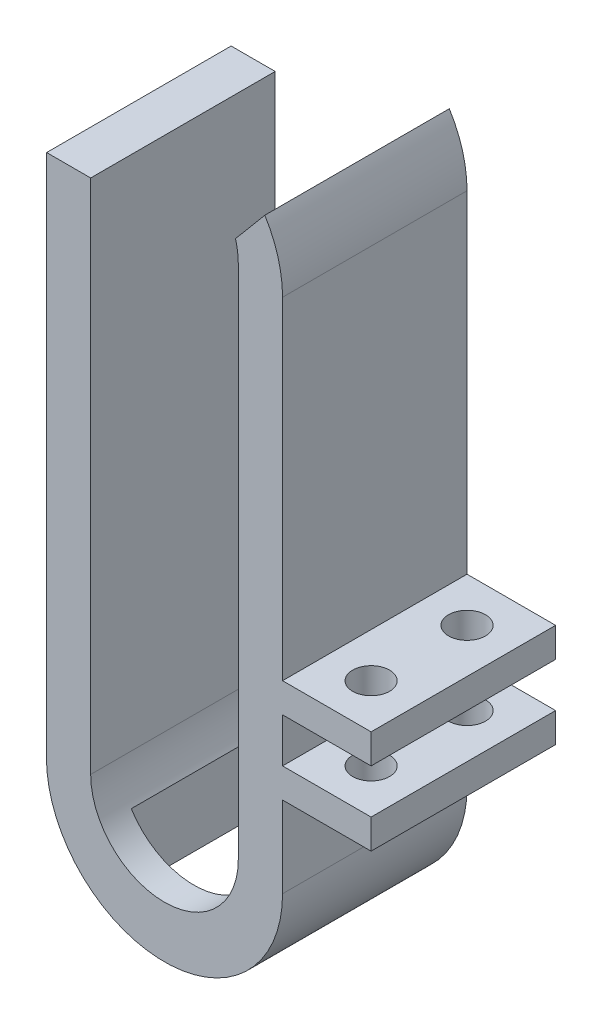
ISO-10303-21;
HEADER;
FILE_DESCRIPTION(('STEP AP214'),'2;1');
FILE_NAME('part.step','',(''),(''),'','','');
FILE_SCHEMA(('AUTOMOTIVE_DESIGN { 1 0 10303 214 1 1 1 1 }'));
ENDSEC;
DATA;
#1=APPLICATION_CONTEXT('core data for automotive mechanical design processes');
#2=APPLICATION_PROTOCOL_DEFINITION('international standard','automotive_design',2000,#1);
#3=PRODUCT_CONTEXT('',#1,'mechanical');
#4=PRODUCT('Part','Part','',(#3));
#5=PRODUCT_RELATED_PRODUCT_CATEGORY('part','',(#4));
#6=PRODUCT_DEFINITION_FORMATION('','',#4);
#7=PRODUCT_DEFINITION_CONTEXT('part definition',#1,'design');
#8=PRODUCT_DEFINITION('design','',#6,#7);
#9=PRODUCT_DEFINITION_SHAPE('','',#8);
#10=(LENGTH_UNIT() NAMED_UNIT(*) SI_UNIT(.MILLI.,.METRE.));
#11=(NAMED_UNIT(*) PLANE_ANGLE_UNIT() SI_UNIT($,.RADIAN.));
#12=(NAMED_UNIT(*) SI_UNIT($,.STERADIAN.) SOLID_ANGLE_UNIT());
#13=UNCERTAINTY_MEASURE_WITH_UNIT(LENGTH_MEASURE(1.E-05),#10,'distance_accuracy_value','');
#14=(GEOMETRIC_REPRESENTATION_CONTEXT(3) GLOBAL_UNCERTAINTY_ASSIGNED_CONTEXT((#13)) GLOBAL_UNIT_ASSIGNED_CONTEXT((#10,
#11,#12)) REPRESENTATION_CONTEXT('',''));
#15=CARTESIAN_POINT('',(0.,0.,0.));
#16=DIRECTION('',(0.,0.,1.));
#17=DIRECTION('',(1.,0.,0.));
#18=AXIS2_PLACEMENT_3D('',#15,#16,#17);
#19=CARTESIAN_POINT('',(7.99999999999995,0.,12.5));
#20=DIRECTION('',(1.,0.,0.));
#21=DIRECTION('',(0.,1.,0.));
#22=AXIS2_PLACEMENT_3D('',#19,#20,#21);
#23=PLANE('',#22);
#24=DIRECTION('',(0.,-1.,0.));
#25=VECTOR('',#24,1.);
#26=CARTESIAN_POINT('',(7.99999999999995,0.,0.));
#27=LINE('',#26,#25);
#28=CARTESIAN_POINT('',(7.99999999999994,-7.5,0.));
#29=VERTEX_POINT('',#28);
#30=CARTESIAN_POINT('',(7.99999999999995,-10.5,0.));
#31=VERTEX_POINT('',#30);
#32=EDGE_CURVE('E278',#29,#31,#27,.T.);
#33=ORIENTED_EDGE('',*,*,#32,.F.);
#34=DIRECTION('',(0.,0.,-1.));
#35=VECTOR('',#34,1.);
#36=CARTESIAN_POINT('',(7.99999999999995,-7.5,12.5));
#37=LINE('',#36,#35);
#38=CARTESIAN_POINT('',(7.99999999999995,-7.5,12.5));
#39=VERTEX_POINT('',#38);
#40=EDGE_CURVE('E347',#39,#29,#37,.T.);
#41=ORIENTED_EDGE('',*,*,#40,.F.);
#42=DIRECTION('',(0.,-1.,0.));
#43=VECTOR('',#42,1.);
#44=CARTESIAN_POINT('',(7.99999999999995,0.,12.5));
#45=LINE('',#44,#43);
#46=CARTESIAN_POINT('',(7.99999999999995,-10.5,12.5));
#47=VERTEX_POINT('',#46);
#48=EDGE_CURVE('E308',#39,#47,#45,.T.);
#49=ORIENTED_EDGE('',*,*,#48,.T.);
#50=DIRECTION('',(0.,0.,1.));
#51=VECTOR('',#50,1.);
#52=CARTESIAN_POINT('',(7.99999999999995,-10.5,12.5));
#53=LINE('',#52,#51);
#54=EDGE_CURVE('E320',#31,#47,#53,.T.);
#55=ORIENTED_EDGE('',*,*,#54,.F.);
#56=EDGE_LOOP('',(#33,#41,#49,#55));
#57=FACE_BOUND('',#56,.T.);
#58=ADVANCED_FACE('F37',(#57),#23,.T.);
#59=CARTESIAN_POINT('',(7.99999999999995,17.,12.5));
#60=VERTEX_POINT('',#59);
#61=CARTESIAN_POINT('',(7.99999999999995,-5.5,12.5));
#62=VERTEX_POINT('',#61);
#63=EDGE_CURVE('E305',#60,#62,#45,.T.);
#64=ORIENTED_EDGE('',*,*,#63,.T.);
#65=DIRECTION('',(0.,0.,1.));
#66=VECTOR('',#65,1.);
#67=CARTESIAN_POINT('',(7.99999999999995,-5.5,12.5));
#68=LINE('',#67,#66);
#69=CARTESIAN_POINT('',(7.99999999999995,-5.5,0.));
#70=VERTEX_POINT('',#69);
#71=EDGE_CURVE('E344',#70,#62,#68,.T.);
#72=ORIENTED_EDGE('',*,*,#71,.F.);
#73=CARTESIAN_POINT('',(7.99999999999995,17.,0.));
#74=VERTEX_POINT('',#73);
#75=EDGE_CURVE('E275',#74,#70,#27,.T.);
#76=ORIENTED_EDGE('',*,*,#75,.F.);
#77=DIRECTION('',(0.,0.,-1.));
#78=VECTOR('',#77,1.);
#79=CARTESIAN_POINT('',(7.99999999999995,17.,12.5));
#80=LINE('',#79,#78);
#81=EDGE_CURVE('E194',#60,#74,#80,.T.);
#82=ORIENTED_EDGE('',*,*,#81,.F.);
#83=EDGE_LOOP('',(#64,#72,#76,#82));
#84=FACE_BOUND('',#83,.T.);
#85=ADVANCED_FACE('F401',(#84),#23,.T.);
#86=CARTESIAN_POINT('',(7.99999999999994,-12.5,0.));
#87=VERTEX_POINT('',#86);
#88=CARTESIAN_POINT('',(7.99999999999994,-18.,0.));
#89=VERTEX_POINT('',#88);
#90=EDGE_CURVE('E279',#87,#89,#27,.T.);
#91=ORIENTED_EDGE('',*,*,#90,.F.);
#92=DIRECTION('',(0.,0.,-1.));
#93=VECTOR('',#92,1.);
#94=CARTESIAN_POINT('',(7.99999999999995,-12.5,12.5));
#95=LINE('',#94,#93);
#96=CARTESIAN_POINT('',(7.99999999999995,-12.5,12.5));
#97=VERTEX_POINT('',#96);
#98=EDGE_CURVE('E324',#97,#87,#95,.T.);
#99=ORIENTED_EDGE('',*,*,#98,.F.);
#100=CARTESIAN_POINT('',(7.99999999999994,-18.,12.5));
#101=VERTEX_POINT('',#100);
#102=EDGE_CURVE('E249',#97,#101,#45,.T.);
#103=ORIENTED_EDGE('',*,*,#102,.T.);
#104=DIRECTION('',(0.,0.,-1.));
#105=VECTOR('',#104,1.);
#106=CARTESIAN_POINT('',(7.99999999999994,-18.,12.5));
#107=LINE('',#106,#105);
#108=EDGE_CURVE('E242',#101,#89,#107,.T.);
#109=ORIENTED_EDGE('',*,*,#108,.T.);
#110=EDGE_LOOP('',(#91,#99,#103,#109));
#111=FACE_BOUND('',#110,.T.);
#112=ADVANCED_FACE('F39',(#111),#23,.T.);
#113=CARTESIAN_POINT('',(0.,17.,12.5));
#114=DIRECTION('',(0.,0.,-1.));
#115=DIRECTION('',(-1.,0.,0.));
#116=AXIS2_PLACEMENT_3D('',#113,#114,#115);
#117=CYLINDRICAL_SURFACE('',#116,7.99999999999998);
#118=CARTESIAN_POINT('',(0.,17.,0.));
#119=DIRECTION('',(0.,0.,1.));
#120=DIRECTION('',(1.,0.,0.));
#121=AXIS2_PLACEMENT_3D('',#118,#119,#120);
#122=CIRCLE('',#121,7.99999999999998);
#123=CARTESIAN_POINT('',(6.80020674968517,21.2139278780653,0.));
#124=VERTEX_POINT('',#123);
#125=EDGE_CURVE('E272',#74,#124,#122,.T.);
#126=ORIENTED_EDGE('',*,*,#125,.T.);
#127=DIRECTION('',(0.,0.,-1.));
#128=VECTOR('',#127,1.);
#129=CARTESIAN_POINT('',(6.80020674968517,21.2139278780653,12.5));
#130=LINE('',#129,#128);
#131=CARTESIAN_POINT('',(6.80020674968517,21.2139278780653,12.5));
#132=VERTEX_POINT('',#131);
#133=EDGE_CURVE('E222',#132,#124,#130,.T.);
#134=ORIENTED_EDGE('',*,*,#133,.F.);
#135=CARTESIAN_POINT('',(0.,17.,12.5));
#136=DIRECTION('',(0.,0.,1.));
#137=DIRECTION('',(1.,0.,0.));
#138=AXIS2_PLACEMENT_3D('',#135,#136,#137);
#139=CIRCLE('',#138,7.99999999999998);
#140=EDGE_CURVE('E303',#60,#132,#139,.T.);
#141=ORIENTED_EDGE('',*,*,#140,.F.);
#142=ORIENTED_EDGE('',*,*,#81,.T.);
#143=EDGE_LOOP('',(#126,#134,#141,#142));
#144=FACE_BOUND('',#143,.T.);
#145=ADVANCED_FACE('F409',(#144),#117,.T.);
#146=CARTESIAN_POINT('',(-6.45529519331706,5.4166358158528,12.5));
#147=DIRECTION('',(-0.766044443118979,0.642787609686539,0.));
#148=DIRECTION('',(-0.642787609686539,-0.766044443118979,0.));
#149=AXIS2_PLACEMENT_3D('',#146,#147,#148);
#150=PLANE('',#149);
#151=DIRECTION('',(0.642787609686539,0.766044443118979,0.));
#152=VECTOR('',#151,1.);
#153=CARTESIAN_POINT('',(-6.45529519331706,5.4166358158528,0.));
#154=LINE('',#153,#152);
#155=CARTESIAN_POINT('',(4.81488589525654,18.8479146173477,0.));
#156=VERTEX_POINT('',#155);
#157=EDGE_CURVE('E269',#156,#124,#154,.T.);
#158=ORIENTED_EDGE('',*,*,#157,.F.);
#159=DIRECTION('',(0.,0.,-1.));
#160=VECTOR('',#159,1.);
#161=CARTESIAN_POINT('',(4.81488589525654,18.8479146173477,12.5));
#162=LINE('',#161,#160);
#163=CARTESIAN_POINT('',(4.81488589525654,18.8479146173477,12.5));
#164=VERTEX_POINT('',#163);
#165=EDGE_CURVE('E224',#164,#156,#162,.T.);
#166=ORIENTED_EDGE('',*,*,#165,.F.);
#167=DIRECTION('',(0.642787609686539,0.766044443118979,0.));
#168=VECTOR('',#167,1.);
#169=CARTESIAN_POINT('',(-6.45529519331706,5.4166358158528,12.5));
#170=LINE('',#169,#168);
#171=EDGE_CURVE('E300',#164,#132,#170,.T.);
#172=ORIENTED_EDGE('',*,*,#171,.T.);
#173=ORIENTED_EDGE('',*,*,#133,.T.);
#174=EDGE_LOOP('',(#158,#166,#172,#173));
#175=FACE_BOUND('',#174,.T.);
#176=ADVANCED_FACE('F414',(#175),#150,.T.);
#177=CARTESIAN_POINT('',(0.,17.5,12.5));
#178=DIRECTION('',(0.,0.,-1.));
#179=DIRECTION('',(-1.,0.,0.));
#180=AXIS2_PLACEMENT_3D('',#177,#178,#179);
#181=CYLINDRICAL_SURFACE('',#180,5.00000000000001);
#182=CARTESIAN_POINT('',(0.,17.5,0.));
#183=DIRECTION('',(0.,0.,1.));
#184=DIRECTION('',(1.,0.,0.));
#185=AXIS2_PLACEMENT_3D('',#182,#183,#184);
#186=CIRCLE('',#185,5.00000000000001);
#187=CARTESIAN_POINT('',(5.00000000000001,17.5,0.));
#188=VERTEX_POINT('',#187);
#189=EDGE_CURVE('E266',#188,#156,#186,.T.);
#190=ORIENTED_EDGE('',*,*,#189,.F.);
#191=DIRECTION('',(0.,0.,-1.));
#192=VECTOR('',#191,1.);
#193=CARTESIAN_POINT('',(5.00000000000001,17.5,12.5));
#194=LINE('',#193,#192);
#195=CARTESIAN_POINT('',(5.00000000000001,17.5,12.5));
#196=VERTEX_POINT('',#195);
#197=EDGE_CURVE('E226',#196,#188,#194,.T.);
#198=ORIENTED_EDGE('',*,*,#197,.F.);
#199=CARTESIAN_POINT('',(0.,17.5,12.5));
#200=DIRECTION('',(0.,0.,1.));
#201=DIRECTION('',(1.,0.,0.));
#202=AXIS2_PLACEMENT_3D('',#199,#200,#201);
#203=CIRCLE('',#202,5.00000000000001);
#204=EDGE_CURVE('E297',#196,#164,#203,.T.);
#205=ORIENTED_EDGE('',*,*,#204,.T.);
#206=ORIENTED_EDGE('',*,*,#165,.T.);
#207=EDGE_LOOP('',(#190,#198,#205,#206));
#208=FACE_BOUND('',#207,.T.);
#209=ADVANCED_FACE('F467',(#208),#181,.F.);
#210=CARTESIAN_POINT('',(5.00000000000001,0.,12.5));
#211=DIRECTION('',(1.,0.,0.));
#212=DIRECTION('',(0.,0.,-1.));
#213=AXIS2_PLACEMENT_3D('',#210,#211,#212);
#214=PLANE('',#213);
#215=DIRECTION('',(0.,-1.,0.));
#216=VECTOR('',#215,1.);
#217=CARTESIAN_POINT('',(5.00000000000001,0.,0.));
#218=LINE('',#217,#216);
#219=CARTESIAN_POINT('',(5.00000000000001,-17.5,0.));
#220=VERTEX_POINT('',#219);
#221=EDGE_CURVE('E263',#188,#220,#218,.T.);
#222=ORIENTED_EDGE('',*,*,#221,.T.);
#223=DIRECTION('',(0.,0.,-1.));
#224=VECTOR('',#223,1.);
#225=CARTESIAN_POINT('',(5.00000000000001,-17.5,12.5));
#226=LINE('',#225,#224);
#227=CARTESIAN_POINT('',(5.00000000000001,-17.5,12.5));
#228=VERTEX_POINT('',#227);
#229=EDGE_CURVE('E228',#228,#220,#226,.T.);
#230=ORIENTED_EDGE('',*,*,#229,.F.);
#231=DIRECTION('',(0.,-1.,0.));
#232=VECTOR('',#231,1.);
#233=CARTESIAN_POINT('',(5.00000000000001,0.,12.5));
#234=LINE('',#233,#232);
#235=EDGE_CURVE('E295',#196,#228,#234,.T.);
#236=ORIENTED_EDGE('',*,*,#235,.F.);
#237=ORIENTED_EDGE('',*,*,#197,.T.);
#238=EDGE_LOOP('',(#222,#230,#236,#237));
#239=FACE_BOUND('',#238,.T.);
#240=ADVANCED_FACE('F464',(#239),#214,.F.);
#241=CARTESIAN_POINT('',(0.,-17.5,12.5));
#242=DIRECTION('',(0.,0.,-1.));
#243=DIRECTION('',(-1.,0.,0.));
#244=AXIS2_PLACEMENT_3D('',#241,#242,#243);
#245=CYLINDRICAL_SURFACE('',#244,5.00000000000001);
#246=DIRECTION('',(0.,0.,-1.));
#247=VECTOR('',#246,1.);
#248=CARTESIAN_POINT('',(-4.25,-20.1339134382132,12.5));
#249=LINE('',#248,#247);
#250=CARTESIAN_POINT('',(-4.25,-20.1339134382132,2.));
#251=VERTEX_POINT('',#250);
#252=CARTESIAN_POINT('',(-4.25,-20.1339134382132,10.5));
#253=VERTEX_POINT('',#252);
#254=EDGE_CURVE('E201',#251,#253,#249,.F.);
#255=ORIENTED_EDGE('',*,*,#254,.F.);
#256=CARTESIAN_POINT('',(0.,-17.5,2.));
#257=DIRECTION('',(0.,0.,-1.));
#258=DIRECTION('',(-1.,0.,0.));
#259=AXIS2_PLACEMENT_3D('',#256,#257,#258);
#260=CIRCLE('',#259,5.00000000000001);
#261=CARTESIAN_POINT('',(4.25,-20.1339134382132,2.));
#262=VERTEX_POINT('',#261);
#263=EDGE_CURVE('E373',#262,#251,#260,.T.);
#264=ORIENTED_EDGE('',*,*,#263,.F.);
#265=DIRECTION('',(0.,0.,-1.));
#266=VECTOR('',#265,1.);
#267=CARTESIAN_POINT('',(4.25,-20.1339134382132,12.5));
#268=LINE('',#267,#266);
#269=CARTESIAN_POINT('',(4.25,-20.1339134382132,10.5));
#270=VERTEX_POINT('',#269);
#271=EDGE_CURVE('E375',#270,#262,#268,.T.);
#272=ORIENTED_EDGE('',*,*,#271,.F.);
#273=CARTESIAN_POINT('',(0.,-17.5,10.5));
#274=DIRECTION('',(0.,0.,1.));
#275=DIRECTION('',(1.,0.,0.));
#276=AXIS2_PLACEMENT_3D('',#273,#274,#275);
#277=CIRCLE('',#276,5.00000000000001);
#278=EDGE_CURVE('E377',#253,#270,#277,.T.);
#279=ORIENTED_EDGE('',*,*,#278,.F.);
#280=EDGE_LOOP('',(#255,#264,#272,#279));
#281=FACE_BOUND('',#280,.T.);
#282=CARTESIAN_POINT('',(0.,-17.5,0.));
#283=DIRECTION('',(0.,0.,1.));
#284=DIRECTION('',(1.,0.,0.));
#285=AXIS2_PLACEMENT_3D('',#282,#283,#284);
#286=CIRCLE('',#285,5.00000000000001);
#287=CARTESIAN_POINT('',(-5.,-17.5,0.));
#288=VERTEX_POINT('',#287);
#289=EDGE_CURVE('E260',#288,#220,#286,.T.);
#290=ORIENTED_EDGE('',*,*,#289,.F.);
#291=DIRECTION('',(0.,0.,-1.));
#292=VECTOR('',#291,1.);
#293=CARTESIAN_POINT('',(-5.,-17.5,12.5));
#294=LINE('',#293,#292);
#295=CARTESIAN_POINT('',(-5.,-17.5,12.5));
#296=VERTEX_POINT('',#295);
#297=EDGE_CURVE('E230',#296,#288,#294,.T.);
#298=ORIENTED_EDGE('',*,*,#297,.F.);
#299=CARTESIAN_POINT('',(0.,-17.5,12.5));
#300=DIRECTION('',(0.,0.,1.));
#301=DIRECTION('',(1.,0.,0.));
#302=AXIS2_PLACEMENT_3D('',#299,#300,#301);
#303=CIRCLE('',#302,5.00000000000001);
#304=EDGE_CURVE('E292',#296,#228,#303,.T.);
#305=ORIENTED_EDGE('',*,*,#304,.T.);
#306=ORIENTED_EDGE('',*,*,#229,.T.);
#307=EDGE_LOOP('',(#290,#298,#305,#306));
#308=FACE_BOUND('',#307,.T.);
#309=ADVANCED_FACE('F385',(#281,#308),#245,.F.);
#310=CARTESIAN_POINT('',(-5.,0.,12.5));
#311=DIRECTION('',(1.,0.,0.));
#312=DIRECTION('',(0.,1.,0.));
#313=AXIS2_PLACEMENT_3D('',#310,#311,#312);
#314=PLANE('',#313);
#315=DIRECTION('',(0.,-1.,0.));
#316=VECTOR('',#315,1.);
#317=CARTESIAN_POINT('',(-5.,0.,0.));
#318=LINE('',#317,#316);
#319=CARTESIAN_POINT('',(-5.,17.5,0.));
#320=VERTEX_POINT('',#319);
#321=EDGE_CURVE('E257',#320,#288,#318,.T.);
#322=ORIENTED_EDGE('',*,*,#321,.F.);
#323=DIRECTION('',(0.,0.,-1.));
#324=VECTOR('',#323,1.);
#325=CARTESIAN_POINT('',(-5.,17.5,12.5));
#326=LINE('',#325,#324);
#327=CARTESIAN_POINT('',(-5.,17.5,12.5));
#328=VERTEX_POINT('',#327);
#329=EDGE_CURVE('E232',#328,#320,#326,.T.);
#330=ORIENTED_EDGE('',*,*,#329,.F.);
#331=DIRECTION('',(0.,-1.,0.));
#332=VECTOR('',#331,1.);
#333=CARTESIAN_POINT('',(-5.,0.,12.5));
#334=LINE('',#333,#332);
#335=EDGE_CURVE('E289',#328,#296,#334,.T.);
#336=ORIENTED_EDGE('',*,*,#335,.T.);
#337=ORIENTED_EDGE('',*,*,#297,.T.);
#338=EDGE_LOOP('',(#322,#330,#336,#337));
#339=FACE_BOUND('',#338,.T.);
#340=ADVANCED_FACE('F458',(#339),#314,.T.);
#341=CARTESIAN_POINT('',(0.,17.5,12.5));
#342=DIRECTION('',(0.,1.,0.));
#343=DIRECTION('',(0.,0.,1.));
#344=AXIS2_PLACEMENT_3D('',#341,#342,#343);
#345=PLANE('',#344);
#346=DIRECTION('',(1.,0.,0.));
#347=VECTOR('',#346,1.);
#348=CARTESIAN_POINT('',(0.,17.5,0.));
#349=LINE('',#348,#347);
#350=CARTESIAN_POINT('',(-7.98435971133566,17.5,0.));
#351=VERTEX_POINT('',#350);
#352=EDGE_CURVE('E254',#351,#320,#349,.T.);
#353=ORIENTED_EDGE('',*,*,#352,.F.);
#354=DIRECTION('',(0.,0.,-1.));
#355=VECTOR('',#354,1.);
#356=CARTESIAN_POINT('',(-7.98435971133566,17.5,12.5));
#357=LINE('',#356,#355);
#358=CARTESIAN_POINT('',(-7.98435971133566,17.5,12.5));
#359=VERTEX_POINT('',#358);
#360=EDGE_CURVE('E234',#359,#351,#357,.T.);
#361=ORIENTED_EDGE('',*,*,#360,.F.);
#362=DIRECTION('',(1.,0.,0.));
#363=VECTOR('',#362,1.);
#364=CARTESIAN_POINT('',(0.,17.5,12.5));
#365=LINE('',#364,#363);
#366=EDGE_CURVE('E286',#359,#328,#365,.T.);
#367=ORIENTED_EDGE('',*,*,#366,.T.);
#368=ORIENTED_EDGE('',*,*,#329,.T.);
#369=EDGE_LOOP('',(#353,#361,#367,#368));
#370=FACE_BOUND('',#369,.T.);
#371=ADVANCED_FACE('F453',(#370),#345,.T.);
#372=CARTESIAN_POINT('',(0.,17.,12.5));
#373=DIRECTION('',(0.,0.,-1.));
#374=DIRECTION('',(-1.,0.,0.));
#375=AXIS2_PLACEMENT_3D('',#372,#373,#374);
#376=CYLINDRICAL_SURFACE('',#375,7.99999999999998);
#377=CARTESIAN_POINT('',(0.,17.,0.));
#378=DIRECTION('',(0.,0.,1.));
#379=DIRECTION('',(1.,0.,0.));
#380=AXIS2_PLACEMENT_3D('',#377,#378,#379);
#381=CIRCLE('',#380,7.99999999999998);
#382=CARTESIAN_POINT('',(-8.,17.,0.));
#383=VERTEX_POINT('',#382);
#384=EDGE_CURVE('E252',#351,#383,#381,.T.);
#385=ORIENTED_EDGE('',*,*,#384,.T.);
#386=DIRECTION('',(0.,0.,-1.));
#387=VECTOR('',#386,1.);
#388=CARTESIAN_POINT('',(-8.,17.,12.5));
#389=LINE('',#388,#387);
#390=CARTESIAN_POINT('',(-8.,17.,12.5));
#391=VERTEX_POINT('',#390);
#392=EDGE_CURVE('E236',#391,#383,#389,.T.);
#393=ORIENTED_EDGE('',*,*,#392,.F.);
#394=CARTESIAN_POINT('',(0.,17.,12.5));
#395=DIRECTION('',(0.,0.,1.));
#396=DIRECTION('',(1.,0.,0.));
#397=AXIS2_PLACEMENT_3D('',#394,#395,#396);
#398=CIRCLE('',#397,7.99999999999998);
#399=EDGE_CURVE('E284',#359,#391,#398,.T.);
#400=ORIENTED_EDGE('',*,*,#399,.F.);
#401=ORIENTED_EDGE('',*,*,#360,.T.);
#402=EDGE_LOOP('',(#385,#393,#400,#401));
#403=FACE_BOUND('',#402,.T.);
#404=ADVANCED_FACE('F450',(#403),#376,.T.);
#405=CARTESIAN_POINT('',(-8.,0.,12.5));
#406=DIRECTION('',(1.,0.,0.));
#407=DIRECTION('',(0.,1.,0.));
#408=AXIS2_PLACEMENT_3D('',#405,#406,#407);
#409=PLANE('',#408);
#410=DIRECTION('',(0.,-1.,0.));
#411=VECTOR('',#410,1.);
#412=CARTESIAN_POINT('',(-8.,0.,0.));
#413=LINE('',#412,#411);
#414=CARTESIAN_POINT('',(-8.00000000000001,-17.9999996623705,0.));
#415=VERTEX_POINT('',#414);
#416=EDGE_CURVE('E250',#383,#415,#413,.T.);
#417=ORIENTED_EDGE('',*,*,#416,.T.);
#418=DIRECTION('',(0.,0.,-1.));
#419=VECTOR('',#418,1.);
#420=CARTESIAN_POINT('',(-8.00000000000001,-17.9999996623705,12.5));
#421=LINE('',#420,#419);
#422=CARTESIAN_POINT('',(-8.00000000000001,-17.9999996623705,12.5));
#423=VERTEX_POINT('',#422);
#424=EDGE_CURVE('E239',#423,#415,#421,.T.);
#425=ORIENTED_EDGE('',*,*,#424,.F.);
#426=DIRECTION('',(0.,-1.,0.));
#427=VECTOR('',#426,1.);
#428=CARTESIAN_POINT('',(-8.,0.,12.5));
#429=LINE('',#428,#427);
#430=EDGE_CURVE('E282',#391,#423,#429,.T.);
#431=ORIENTED_EDGE('',*,*,#430,.F.);
#432=ORIENTED_EDGE('',*,*,#392,.T.);
#433=EDGE_LOOP('',(#417,#425,#431,#432));
#434=FACE_BOUND('',#433,.T.);
#435=ADVANCED_FACE('F446',(#434),#409,.F.);
#436=CARTESIAN_POINT('',(0.,-17.9999998311853,12.5));
#437=DIRECTION('',(0.,0.,-1.));
#438=DIRECTION('',(-1.,0.,0.));
#439=AXIS2_PLACEMENT_3D('',#436,#437,#438);
#440=CYLINDRICAL_SURFACE('',#439,7.99999999999998);
#441=DIRECTION('',(0.,0.,-1.));
#442=VECTOR('',#441,1.);
#443=CARTESIAN_POINT('',(-4.25,-24.7777206870482,12.5));
#444=LINE('',#443,#442);
#445=CARTESIAN_POINT('',(-4.25,-24.7777206870482,2.));
#446=VERTEX_POINT('',#445);
#447=CARTESIAN_POINT('',(-4.25,-24.7777206870482,10.5));
#448=VERTEX_POINT('',#447);
#449=EDGE_CURVE('E11',#446,#448,#444,.F.);
#450=ORIENTED_EDGE('',*,*,#449,.T.);
#451=CARTESIAN_POINT('',(0.,-17.9999998311853,10.5));
#452=DIRECTION('',(0.,0.,1.));
#453=DIRECTION('',(1.,0.,0.));
#454=AXIS2_PLACEMENT_3D('',#451,#452,#453);
#455=CIRCLE('',#454,7.99999999999998);
#456=CARTESIAN_POINT('',(4.25,-24.7777206870482,10.5));
#457=VERTEX_POINT('',#456);
#458=EDGE_CURVE('E189',#448,#457,#455,.T.);
#459=ORIENTED_EDGE('',*,*,#458,.T.);
#460=DIRECTION('',(0.,0.,-1.));
#461=VECTOR('',#460,1.);
#462=CARTESIAN_POINT('',(4.25,-24.7777206870482,12.5));
#463=LINE('',#462,#461);
#464=CARTESIAN_POINT('',(4.25,-24.7777206870482,2.));
#465=VERTEX_POINT('',#464);
#466=EDGE_CURVE('E193',#457,#465,#463,.T.);
#467=ORIENTED_EDGE('',*,*,#466,.T.);
#468=CARTESIAN_POINT('',(0.,-17.9999998311853,2.));
#469=DIRECTION('',(0.,0.,-1.));
#470=DIRECTION('',(-1.,0.,0.));
#471=AXIS2_PLACEMENT_3D('',#468,#469,#470);
#472=CIRCLE('',#471,7.99999999999998);
#473=EDGE_CURVE('E45',#465,#446,#472,.T.);
#474=ORIENTED_EDGE('',*,*,#473,.T.);
#475=EDGE_LOOP('',(#450,#459,#467,#474));
#476=FACE_BOUND('',#475,.T.);
#477=CARTESIAN_POINT('',(0.,-17.9999998311853,0.));
#478=DIRECTION('',(0.,0.,1.));
#479=DIRECTION('',(1.,0.,0.));
#480=AXIS2_PLACEMENT_3D('',#477,#478,#479);
#481=CIRCLE('',#480,7.99999999999998);
#482=EDGE_CURVE('E246',#415,#89,#481,.T.);
#483=ORIENTED_EDGE('',*,*,#482,.T.);
#484=ORIENTED_EDGE('',*,*,#108,.F.);
#485=CARTESIAN_POINT('',(0.,-17.9999998311853,12.5));
#486=DIRECTION('',(0.,0.,1.));
#487=DIRECTION('',(1.,0.,0.));
#488=AXIS2_PLACEMENT_3D('',#485,#486,#487);
#489=CIRCLE('',#488,7.99999999999998);
#490=EDGE_CURVE('E245',#423,#101,#489,.T.);
#491=ORIENTED_EDGE('',*,*,#490,.F.);
#492=ORIENTED_EDGE('',*,*,#424,.T.);
#493=EDGE_LOOP('',(#483,#484,#491,#492));
#494=FACE_BOUND('',#493,.T.);
#495=ADVANCED_FACE('F205',(#476,#494),#440,.T.);
#496=CARTESIAN_POINT('',(0.,0.,12.5));
#497=DIRECTION('',(0.,0.,1.));
#498=DIRECTION('',(1.,0.,0.));
#499=AXIS2_PLACEMENT_3D('',#496,#497,#498);
#500=PLANE('',#499);
#501=ORIENTED_EDGE('',*,*,#63,.F.);
#502=ORIENTED_EDGE('',*,*,#140,.T.);
#503=ORIENTED_EDGE('',*,*,#171,.F.);
#504=ORIENTED_EDGE('',*,*,#204,.F.);
#505=ORIENTED_EDGE('',*,*,#235,.T.);
#506=ORIENTED_EDGE('',*,*,#304,.F.);
#507=ORIENTED_EDGE('',*,*,#335,.F.);
#508=ORIENTED_EDGE('',*,*,#366,.F.);
#509=ORIENTED_EDGE('',*,*,#399,.T.);
#510=ORIENTED_EDGE('',*,*,#430,.T.);
#511=ORIENTED_EDGE('',*,*,#490,.T.);
#512=ORIENTED_EDGE('',*,*,#102,.F.);
#513=DIRECTION('',(-1.,0.,0.));
#514=VECTOR('',#513,1.);
#515=CARTESIAN_POINT('',(14.,-12.5,12.5));
#516=LINE('',#515,#514);
#517=CARTESIAN_POINT('',(14.,-12.5,12.5));
#518=VERTEX_POINT('',#517);
#519=EDGE_CURVE('E309',#518,#97,#516,.T.);
#520=ORIENTED_EDGE('',*,*,#519,.F.);
#521=DIRECTION('',(0.,-1.,0.));
#522=VECTOR('',#521,1.);
#523=CARTESIAN_POINT('',(14.,-12.5,12.5));
#524=LINE('',#523,#522);
#525=CARTESIAN_POINT('',(13.9999999999999,-10.5,12.5));
#526=VERTEX_POINT('',#525);
#527=EDGE_CURVE('E323',#526,#518,#524,.T.);
#528=ORIENTED_EDGE('',*,*,#527,.F.);
#529=DIRECTION('',(-1.,0.,0.));
#530=VECTOR('',#529,1.);
#531=CARTESIAN_POINT('',(13.9999999999999,-10.5,12.5));
#532=LINE('',#531,#530);
#533=EDGE_CURVE('E316',#526,#47,#532,.T.);
#534=ORIENTED_EDGE('',*,*,#533,.T.);
#535=ORIENTED_EDGE('',*,*,#48,.F.);
#536=DIRECTION('',(-1.,0.,0.));
#537=VECTOR('',#536,1.);
#538=CARTESIAN_POINT('',(13.9999999999999,-7.5,12.5));
#539=LINE('',#538,#537);
#540=CARTESIAN_POINT('',(13.9999999999999,-7.5,12.5));
#541=VERTEX_POINT('',#540);
#542=EDGE_CURVE('E327',#541,#39,#539,.T.);
#543=ORIENTED_EDGE('',*,*,#542,.F.);
#544=DIRECTION('',(0.,-1.,0.));
#545=VECTOR('',#544,1.);
#546=CARTESIAN_POINT('',(13.9999999999999,-5.5,12.5));
#547=LINE('',#546,#545);
#548=CARTESIAN_POINT('',(13.9999999999999,-5.5,12.5));
#549=VERTEX_POINT('',#548);
#550=EDGE_CURVE('E346',#549,#541,#547,.T.);
#551=ORIENTED_EDGE('',*,*,#550,.F.);
#552=DIRECTION('',(-1.,0.,0.));
#553=VECTOR('',#552,1.);
#554=CARTESIAN_POINT('',(13.9999999999999,-5.5,12.5));
#555=LINE('',#554,#553);
#556=EDGE_CURVE('E340',#549,#62,#555,.T.);
#557=ORIENTED_EDGE('',*,*,#556,.T.);
#558=EDGE_LOOP('',(#501,#502,#503,#504,#505,#506,#507,#508,#509,#510,#511,#512,#520,#528,#534,
#535,#543,#551,#557));
#559=FACE_BOUND('',#558,.T.);
#560=ADVANCED_FACE('F439',(#559),#500,.T.);
#561=CARTESIAN_POINT('',(0.,0.,0.));
#562=DIRECTION('',(0.,0.,1.));
#563=DIRECTION('',(1.,0.,0.));
#564=AXIS2_PLACEMENT_3D('',#561,#562,#563);
#565=PLANE('',#564);
#566=ORIENTED_EDGE('',*,*,#75,.T.);
#567=DIRECTION('',(-1.,0.,0.));
#568=VECTOR('',#567,1.);
#569=CARTESIAN_POINT('',(13.9999999999999,-5.5,0.));
#570=LINE('',#569,#568);
#571=CARTESIAN_POINT('',(13.9999999999999,-5.5,0.));
#572=VERTEX_POINT('',#571);
#573=EDGE_CURVE('E338',#572,#70,#570,.T.);
#574=ORIENTED_EDGE('',*,*,#573,.F.);
#575=DIRECTION('',(0.,1.,0.));
#576=VECTOR('',#575,1.);
#577=CARTESIAN_POINT('',(13.9999999999999,-5.5,0.));
#578=LINE('',#577,#576);
#579=CARTESIAN_POINT('',(13.9999999999999,-7.5,0.));
#580=VERTEX_POINT('',#579);
#581=EDGE_CURVE('E352',#580,#572,#578,.T.);
#582=ORIENTED_EDGE('',*,*,#581,.F.);
#583=DIRECTION('',(-1.,0.,0.));
#584=VECTOR('',#583,1.);
#585=CARTESIAN_POINT('',(13.9999999999999,-7.5,0.));
#586=LINE('',#585,#584);
#587=EDGE_CURVE('E336',#580,#29,#586,.T.);
#588=ORIENTED_EDGE('',*,*,#587,.T.);
#589=ORIENTED_EDGE('',*,*,#32,.T.);
#590=DIRECTION('',(-1.,0.,0.));
#591=VECTOR('',#590,1.);
#592=CARTESIAN_POINT('',(13.9999999999999,-10.5,0.));
#593=LINE('',#592,#591);
#594=CARTESIAN_POINT('',(13.9999999999999,-10.5,0.));
#595=VERTEX_POINT('',#594);
#596=EDGE_CURVE('E313',#595,#31,#593,.T.);
#597=ORIENTED_EDGE('',*,*,#596,.F.);
#598=DIRECTION('',(0.,1.,0.));
#599=VECTOR('',#598,1.);
#600=CARTESIAN_POINT('',(14.,-12.5,0.));
#601=LINE('',#600,#599);
#602=CARTESIAN_POINT('',(14.,-12.5,0.));
#603=VERTEX_POINT('',#602);
#604=EDGE_CURVE('E329',#603,#595,#601,.T.);
#605=ORIENTED_EDGE('',*,*,#604,.F.);
#606=DIRECTION('',(-1.,0.,0.));
#607=VECTOR('',#606,1.);
#608=CARTESIAN_POINT('',(14.,-12.5,0.));
#609=LINE('',#608,#607);
#610=EDGE_CURVE('E311',#603,#87,#609,.T.);
#611=ORIENTED_EDGE('',*,*,#610,.T.);
#612=ORIENTED_EDGE('',*,*,#90,.T.);
#613=ORIENTED_EDGE('',*,*,#482,.F.);
#614=ORIENTED_EDGE('',*,*,#416,.F.);
#615=ORIENTED_EDGE('',*,*,#384,.F.);
#616=ORIENTED_EDGE('',*,*,#352,.T.);
#617=ORIENTED_EDGE('',*,*,#321,.T.);
#618=ORIENTED_EDGE('',*,*,#289,.T.);
#619=ORIENTED_EDGE('',*,*,#221,.F.);
#620=ORIENTED_EDGE('',*,*,#189,.T.);
#621=ORIENTED_EDGE('',*,*,#157,.T.);
#622=ORIENTED_EDGE('',*,*,#125,.F.);
#623=EDGE_LOOP('',(#566,#574,#582,#588,#589,#597,#605,#611,#612,#613,#614,#615,#616,#617,#618,
#619,#620,#621,#622));
#624=FACE_BOUND('',#623,.T.);
#625=ADVANCED_FACE('F423',(#624),#565,.F.);
#626=CARTESIAN_POINT('',(14.,-12.5,12.5));
#627=DIRECTION('',(0.,1.,0.));
#628=DIRECTION('',(-1.,0.,0.));
#629=AXIS2_PLACEMENT_3D('',#626,#627,#628);
#630=PLANE('',#629);
#631=CARTESIAN_POINT('',(10.9999999999999,-12.5,3.));
#632=DIRECTION('',(0.,1.,0.));
#633=DIRECTION('',(-1.,0.,0.));
#634=AXIS2_PLACEMENT_3D('',#631,#632,#633);
#635=CIRCLE('',#634,1.25);
#636=CARTESIAN_POINT('',(9.74999999999995,-12.5,3.));
#637=VERTEX_POINT('',#636);
#638=EDGE_CURVE('E350',#637,#637,#635,.T.);
#639=ORIENTED_EDGE('',*,*,#638,.T.);
#640=EDGE_LOOP('',(#639));
#641=FACE_BOUND('',#640,.T.);
#642=CARTESIAN_POINT('',(10.9999999999999,-12.5,9.5));
#643=DIRECTION('',(0.,1.,0.));
#644=DIRECTION('',(-1.,0.,0.));
#645=AXIS2_PLACEMENT_3D('',#642,#643,#644);
#646=CIRCLE('',#645,1.25);
#647=CARTESIAN_POINT('',(9.74999999999995,-12.5,9.5));
#648=VERTEX_POINT('',#647);
#649=EDGE_CURVE('E216',#648,#648,#646,.T.);
#650=ORIENTED_EDGE('',*,*,#649,.T.);
#651=EDGE_LOOP('',(#650));
#652=FACE_BOUND('',#651,.T.);
#653=ORIENTED_EDGE('',*,*,#98,.T.);
#654=ORIENTED_EDGE('',*,*,#610,.F.);
#655=DIRECTION('',(0.,0.,-1.));
#656=VECTOR('',#655,1.);
#657=CARTESIAN_POINT('',(14.,-12.5,12.5));
#658=LINE('',#657,#656);
#659=EDGE_CURVE('E331',#518,#603,#658,.T.);
#660=ORIENTED_EDGE('',*,*,#659,.F.);
#661=ORIENTED_EDGE('',*,*,#519,.T.);
#662=EDGE_LOOP('',(#653,#654,#660,#661));
#663=FACE_BOUND('',#662,.T.);
#664=ADVANCED_FACE('F504',(#641,#652,#663),#630,.F.);
#665=CARTESIAN_POINT('',(13.9999999999999,-10.5,12.5));
#666=DIRECTION('',(0.,-1.,0.));
#667=DIRECTION('',(1.,0.,0.));
#668=AXIS2_PLACEMENT_3D('',#665,#666,#667);
#669=PLANE('',#668);
#670=CARTESIAN_POINT('',(10.9999999999999,-10.5,3.));
#671=DIRECTION('',(0.,-1.,0.));
#672=DIRECTION('',(1.,0.,0.));
#673=AXIS2_PLACEMENT_3D('',#670,#671,#672);
#674=CIRCLE('',#673,1.25);
#675=CARTESIAN_POINT('',(12.2499999999999,-10.5,3.));
#676=VERTEX_POINT('',#675);
#677=EDGE_CURVE('E360',#676,#676,#674,.T.);
#678=ORIENTED_EDGE('',*,*,#677,.T.);
#679=EDGE_LOOP('',(#678));
#680=FACE_BOUND('',#679,.T.);
#681=CARTESIAN_POINT('',(10.9999999999999,-10.5,9.5));
#682=DIRECTION('',(0.,-1.,0.));
#683=DIRECTION('',(1.,0.,0.));
#684=AXIS2_PLACEMENT_3D('',#681,#682,#683);
#685=CIRCLE('',#684,1.25);
#686=CARTESIAN_POINT('',(12.2499999999999,-10.5,9.5));
#687=VERTEX_POINT('',#686);
#688=EDGE_CURVE('E367',#687,#687,#685,.T.);
#689=ORIENTED_EDGE('',*,*,#688,.T.);
#690=EDGE_LOOP('',(#689));
#691=FACE_BOUND('',#690,.T.);
#692=ORIENTED_EDGE('',*,*,#54,.T.);
#693=ORIENTED_EDGE('',*,*,#533,.F.);
#694=DIRECTION('',(0.,0.,1.));
#695=VECTOR('',#694,1.);
#696=CARTESIAN_POINT('',(13.9999999999999,-10.5,12.5));
#697=LINE('',#696,#695);
#698=EDGE_CURVE('E319',#595,#526,#697,.T.);
#699=ORIENTED_EDGE('',*,*,#698,.F.);
#700=ORIENTED_EDGE('',*,*,#596,.T.);
#701=EDGE_LOOP('',(#692,#693,#699,#700));
#702=FACE_BOUND('',#701,.T.);
#703=ADVANCED_FACE('F431',(#680,#691,#702),#669,.F.);
#704=CARTESIAN_POINT('',(13.9999999999999,0.,0.));
#705=DIRECTION('',(-1.,0.,0.));
#706=DIRECTION('',(0.,-1.,0.));
#707=AXIS2_PLACEMENT_3D('',#704,#705,#706);
#708=PLANE('',#707);
#709=ORIENTED_EDGE('',*,*,#527,.T.);
#710=ORIENTED_EDGE('',*,*,#659,.T.);
#711=ORIENTED_EDGE('',*,*,#604,.T.);
#712=ORIENTED_EDGE('',*,*,#698,.T.);
#713=EDGE_LOOP('',(#709,#710,#711,#712));
#714=FACE_BOUND('',#713,.T.);
#715=ADVANCED_FACE('F488',(#714),#708,.F.);
#716=CARTESIAN_POINT('',(13.9999999999999,-7.5,12.5));
#717=DIRECTION('',(0.,1.,0.));
#718=DIRECTION('',(-1.,0.,0.));
#719=AXIS2_PLACEMENT_3D('',#716,#717,#718);
#720=PLANE('',#719);
#721=CARTESIAN_POINT('',(10.9999999999999,-7.5,3.));
#722=DIRECTION('',(0.,1.,0.));
#723=DIRECTION('',(-1.,0.,0.));
#724=AXIS2_PLACEMENT_3D('',#721,#722,#723);
#725=CIRCLE('',#724,1.25);
#726=CARTESIAN_POINT('',(9.74999999999994,-7.5,3.));
#727=VERTEX_POINT('',#726);
#728=EDGE_CURVE('E215',#727,#727,#725,.T.);
#729=ORIENTED_EDGE('',*,*,#728,.T.);
#730=EDGE_LOOP('',(#729));
#731=FACE_BOUND('',#730,.T.);
#732=CARTESIAN_POINT('',(10.9999999999999,-7.5,9.5));
#733=DIRECTION('',(0.,1.,0.));
#734=DIRECTION('',(-1.,0.,0.));
#735=AXIS2_PLACEMENT_3D('',#732,#733,#734);
#736=CIRCLE('',#735,1.25);
#737=CARTESIAN_POINT('',(9.74999999999994,-7.5,9.5));
#738=VERTEX_POINT('',#737);
#739=EDGE_CURVE('E220',#738,#738,#736,.T.);
#740=ORIENTED_EDGE('',*,*,#739,.T.);
#741=EDGE_LOOP('',(#740));
#742=FACE_BOUND('',#741,.T.);
#743=ORIENTED_EDGE('',*,*,#40,.T.);
#744=ORIENTED_EDGE('',*,*,#587,.F.);
#745=DIRECTION('',(0.,0.,-1.));
#746=VECTOR('',#745,1.);
#747=CARTESIAN_POINT('',(13.9999999999999,-7.5,12.5));
#748=LINE('',#747,#746);
#749=EDGE_CURVE('E354',#541,#580,#748,.T.);
#750=ORIENTED_EDGE('',*,*,#749,.F.);
#751=ORIENTED_EDGE('',*,*,#542,.T.);
#752=EDGE_LOOP('',(#743,#744,#750,#751));
#753=FACE_BOUND('',#752,.T.);
#754=ADVANCED_FACE('F486',(#731,#742,#753),#720,.F.);
#755=CARTESIAN_POINT('',(13.9999999999999,-5.5,12.5));
#756=DIRECTION('',(0.,-1.,0.));
#757=DIRECTION('',(1.,0.,0.));
#758=AXIS2_PLACEMENT_3D('',#755,#756,#757);
#759=PLANE('',#758);
#760=CARTESIAN_POINT('',(10.9999999999999,-5.5,3.));
#761=DIRECTION('',(0.,-1.,0.));
#762=DIRECTION('',(1.,0.,0.));
#763=AXIS2_PLACEMENT_3D('',#760,#761,#762);
#764=CIRCLE('',#763,1.25);
#765=CARTESIAN_POINT('',(12.2499999999999,-5.5,3.));
#766=VERTEX_POINT('',#765);
#767=EDGE_CURVE('E212',#766,#766,#764,.T.);
#768=ORIENTED_EDGE('',*,*,#767,.T.);
#769=EDGE_LOOP('',(#768));
#770=FACE_BOUND('',#769,.T.);
#771=CARTESIAN_POINT('',(10.9999999999999,-5.5,9.5));
#772=DIRECTION('',(0.,-1.,0.));
#773=DIRECTION('',(1.,0.,0.));
#774=AXIS2_PLACEMENT_3D('',#771,#772,#773);
#775=CIRCLE('',#774,1.25);
#776=CARTESIAN_POINT('',(12.2499999999999,-5.5,9.5));
#777=VERTEX_POINT('',#776);
#778=EDGE_CURVE('E217',#777,#777,#775,.T.);
#779=ORIENTED_EDGE('',*,*,#778,.T.);
#780=EDGE_LOOP('',(#779));
#781=FACE_BOUND('',#780,.T.);
#782=ORIENTED_EDGE('',*,*,#71,.T.);
#783=ORIENTED_EDGE('',*,*,#556,.F.);
#784=DIRECTION('',(0.,0.,1.));
#785=VECTOR('',#784,1.);
#786=CARTESIAN_POINT('',(13.9999999999999,-5.5,12.5));
#787=LINE('',#786,#785);
#788=EDGE_CURVE('E343',#572,#549,#787,.T.);
#789=ORIENTED_EDGE('',*,*,#788,.F.);
#790=ORIENTED_EDGE('',*,*,#573,.T.);
#791=EDGE_LOOP('',(#782,#783,#789,#790));
#792=FACE_BOUND('',#791,.T.);
#793=ADVANCED_FACE('F480',(#770,#781,#792),#759,.F.);
#794=CARTESIAN_POINT('',(13.9999999999999,0.,0.));
#795=DIRECTION('',(1.,0.,0.));
#796=DIRECTION('',(0.,0.,-1.));
#797=AXIS2_PLACEMENT_3D('',#794,#795,#796);
#798=PLANE('',#797);
#799=ORIENTED_EDGE('',*,*,#550,.T.);
#800=ORIENTED_EDGE('',*,*,#749,.T.);
#801=ORIENTED_EDGE('',*,*,#581,.T.);
#802=ORIENTED_EDGE('',*,*,#788,.T.);
#803=EDGE_LOOP('',(#799,#800,#801,#802));
#804=FACE_BOUND('',#803,.T.);
#805=ADVANCED_FACE('F484',(#804),#798,.T.);
#806=CARTESIAN_POINT('',(10.9999999999999,-25.9999998311852,9.5));
#807=DIRECTION('',(0.,1.,0.));
#808=DIRECTION('',(-1.,0.,0.));
#809=AXIS2_PLACEMENT_3D('',#806,#807,#808);
#810=CYLINDRICAL_SURFACE('',#809,1.25);
#811=ORIENTED_EDGE('',*,*,#778,.F.);
#812=EDGE_LOOP('',(#811));
#813=FACE_BOUND('',#812,.T.);
#814=ORIENTED_EDGE('',*,*,#739,.F.);
#815=EDGE_LOOP('',(#814));
#816=FACE_BOUND('',#815,.T.);
#817=ADVANCED_FACE('F597',(#813,#816),#810,.F.);
#818=CARTESIAN_POINT('',(10.9999999999999,-25.9999998311852,3.));
#819=DIRECTION('',(0.,1.,0.));
#820=DIRECTION('',(-1.,0.,0.));
#821=AXIS2_PLACEMENT_3D('',#818,#819,#820);
#822=CYLINDRICAL_SURFACE('',#821,1.25);
#823=ORIENTED_EDGE('',*,*,#767,.F.);
#824=EDGE_LOOP('',(#823));
#825=FACE_BOUND('',#824,.T.);
#826=ORIENTED_EDGE('',*,*,#728,.F.);
#827=EDGE_LOOP('',(#826));
#828=FACE_BOUND('',#827,.T.);
#829=ADVANCED_FACE('F609',(#825,#828),#822,.F.);
#830=ORIENTED_EDGE('',*,*,#688,.F.);
#831=EDGE_LOOP('',(#830));
#832=FACE_BOUND('',#831,.T.);
#833=ORIENTED_EDGE('',*,*,#649,.F.);
#834=EDGE_LOOP('',(#833));
#835=FACE_BOUND('',#834,.T.);
#836=ADVANCED_FACE('F612',(#832,#835),#810,.F.);
#837=ORIENTED_EDGE('',*,*,#677,.F.);
#838=EDGE_LOOP('',(#837));
#839=FACE_BOUND('',#838,.T.);
#840=ORIENTED_EDGE('',*,*,#638,.F.);
#841=EDGE_LOOP('',(#840));
#842=FACE_BOUND('',#841,.T.);
#843=ADVANCED_FACE('F398',(#839,#842),#822,.F.);
#844=CARTESIAN_POINT('',(-4.25,-25.9999998311852,2.));
#845=DIRECTION('',(-1.,0.,0.));
#846=DIRECTION('',(0.,0.,1.));
#847=AXIS2_PLACEMENT_3D('',#844,#845,#846);
#848=PLANE('',#847);
#849=ORIENTED_EDGE('',*,*,#254,.T.);
#850=DIRECTION('',(0.,1.,0.));
#851=VECTOR('',#850,1.);
#852=CARTESIAN_POINT('',(-4.25,-25.9999998311852,10.5));
#853=LINE('',#852,#851);
#854=EDGE_CURVE('E52',#448,#253,#853,.T.);
#855=ORIENTED_EDGE('',*,*,#854,.F.);
#856=ORIENTED_EDGE('',*,*,#449,.F.);
#857=DIRECTION('',(0.,1.,0.));
#858=VECTOR('',#857,1.);
#859=CARTESIAN_POINT('',(-4.25,-25.9999998311852,2.));
#860=LINE('',#859,#858);
#861=EDGE_CURVE('E378',#446,#251,#860,.T.);
#862=ORIENTED_EDGE('',*,*,#861,.T.);
#863=EDGE_LOOP('',(#849,#855,#856,#862));
#864=FACE_BOUND('',#863,.T.);
#865=ADVANCED_FACE('F197',(#864),#848,.F.);
#866=CARTESIAN_POINT('',(-4.25,-25.9999998311852,2.));
#867=DIRECTION('',(0.,0.,-1.));
#868=DIRECTION('',(-1.,0.,0.));
#869=AXIS2_PLACEMENT_3D('',#866,#867,#868);
#870=PLANE('',#869);
#871=ORIENTED_EDGE('',*,*,#263,.T.);
#872=ORIENTED_EDGE('',*,*,#861,.F.);
#873=ORIENTED_EDGE('',*,*,#473,.F.);
#874=DIRECTION('',(0.,1.,0.));
#875=VECTOR('',#874,1.);
#876=CARTESIAN_POINT('',(4.25,-25.9999998311852,2.));
#877=LINE('',#876,#875);
#878=EDGE_CURVE('E381',#465,#262,#877,.T.);
#879=ORIENTED_EDGE('',*,*,#878,.T.);
#880=EDGE_LOOP('',(#871,#872,#873,#879));
#881=FACE_BOUND('',#880,.T.);
#882=ADVANCED_FACE('F390',(#881),#870,.F.);
#883=CARTESIAN_POINT('',(4.25,-25.9999998311852,2.));
#884=DIRECTION('',(1.,0.,0.));
#885=DIRECTION('',(0.,0.,-1.));
#886=AXIS2_PLACEMENT_3D('',#883,#884,#885);
#887=PLANE('',#886);
#888=ORIENTED_EDGE('',*,*,#271,.T.);
#889=ORIENTED_EDGE('',*,*,#878,.F.);
#890=ORIENTED_EDGE('',*,*,#466,.F.);
#891=DIRECTION('',(0.,1.,0.));
#892=VECTOR('',#891,1.);
#893=CARTESIAN_POINT('',(4.25,-25.9999998311852,10.5));
#894=LINE('',#893,#892);
#895=EDGE_CURVE('E57',#457,#270,#894,.T.);
#896=ORIENTED_EDGE('',*,*,#895,.T.);
#897=EDGE_LOOP('',(#888,#889,#890,#896));
#898=FACE_BOUND('',#897,.T.);
#899=ADVANCED_FACE('F389',(#898),#887,.F.);
#900=CARTESIAN_POINT('',(-4.25,-25.9999998311852,10.5));
#901=DIRECTION('',(0.,0.,1.));
#902=DIRECTION('',(1.,0.,0.));
#903=AXIS2_PLACEMENT_3D('',#900,#901,#902);
#904=PLANE('',#903);
#905=ORIENTED_EDGE('',*,*,#278,.T.);
#906=ORIENTED_EDGE('',*,*,#895,.F.);
#907=ORIENTED_EDGE('',*,*,#458,.F.);
#908=ORIENTED_EDGE('',*,*,#854,.T.);
#909=EDGE_LOOP('',(#905,#906,#907,#908));
#910=FACE_BOUND('',#909,.T.);
#911=ADVANCED_FACE('F190',(#910),#904,.F.);
#912=CLOSED_SHELL('',(#58,#85,#112,#145,#176,#209,#240,#309,#340,#371,#404,#435,#495,#560,#625,
#664,#703,#715,#754,#793,#805,#817,#829,#836,#843,#865,#882,#899,#911));
#913=MANIFOLD_SOLID_BREP('B2',#912);
#914=ADVANCED_BREP_SHAPE_REPRESENTATION('',(#18,#913),#14);
#915=SHAPE_DEFINITION_REPRESENTATION(#9,#914);
ENDSEC;
END-ISO-10303-21;
